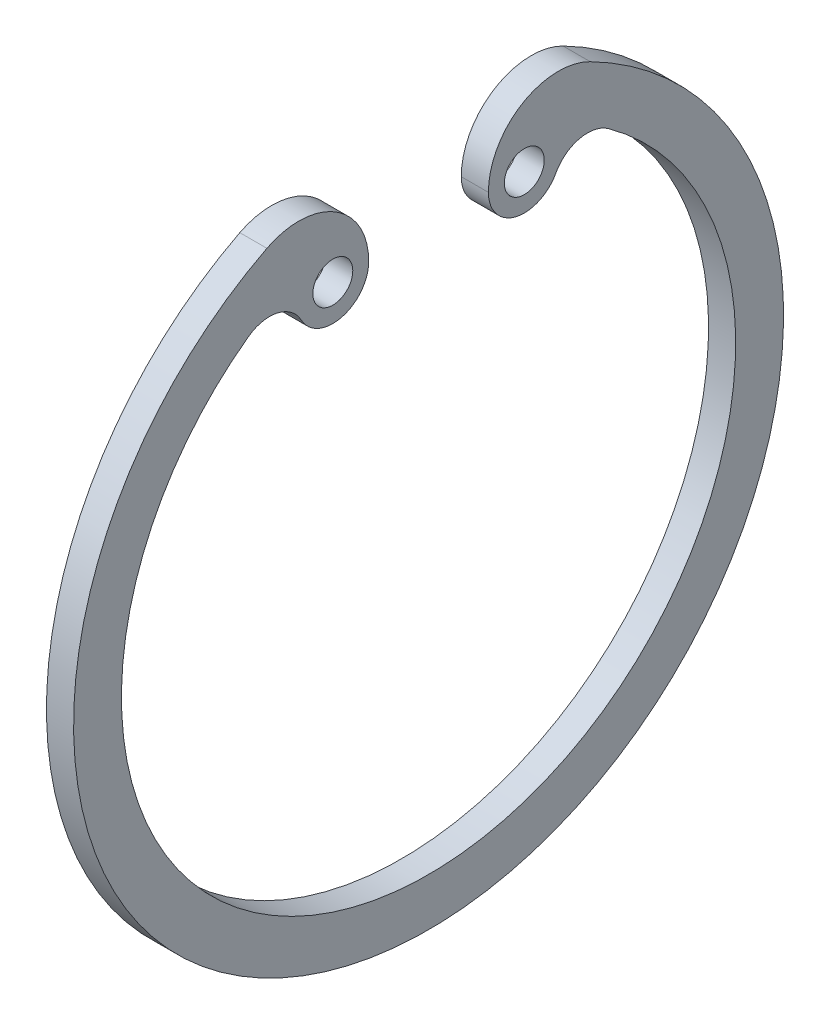
ISO-10303-21;
HEADER;
FILE_DESCRIPTION(('STEP AP214'),'2;1');
FILE_NAME('part.step','',(''),(''),'','','');
FILE_SCHEMA(('AUTOMOTIVE_DESIGN { 1 0 10303 214 1 1 1 1 }'));
ENDSEC;
DATA;
#1=APPLICATION_CONTEXT('core data for automotive mechanical design processes');
#2=APPLICATION_PROTOCOL_DEFINITION('international standard','automotive_design',2000,#1);
#3=PRODUCT_CONTEXT('',#1,'mechanical');
#4=PRODUCT('Part','Part','',(#3));
#5=PRODUCT_RELATED_PRODUCT_CATEGORY('part','',(#4));
#6=PRODUCT_DEFINITION_FORMATION('','',#4);
#7=PRODUCT_DEFINITION_CONTEXT('part definition',#1,'design');
#8=PRODUCT_DEFINITION('design','',#6,#7);
#9=PRODUCT_DEFINITION_SHAPE('','',#8);
#10=(LENGTH_UNIT() NAMED_UNIT(*) SI_UNIT(.MILLI.,.METRE.));
#11=(NAMED_UNIT(*) PLANE_ANGLE_UNIT() SI_UNIT($,.RADIAN.));
#12=(NAMED_UNIT(*) SI_UNIT($,.STERADIAN.) SOLID_ANGLE_UNIT());
#13=UNCERTAINTY_MEASURE_WITH_UNIT(LENGTH_MEASURE(1.E-05),#10,'distance_accuracy_value','');
#14=(GEOMETRIC_REPRESENTATION_CONTEXT(3) GLOBAL_UNCERTAINTY_ASSIGNED_CONTEXT((#13)) GLOBAL_UNIT_ASSIGNED_CONTEXT((#10,
#11,#12)) REPRESENTATION_CONTEXT('',''));
#15=CARTESIAN_POINT('',(0.,0.,0.));
#16=DIRECTION('',(0.,0.,1.));
#17=DIRECTION('',(1.,0.,0.));
#18=AXIS2_PLACEMENT_3D('',#15,#16,#17);
#19=CARTESIAN_POINT('',(1.7,15.9059737205869,7.0673076923077));
#20=DIRECTION('',(-1.,0.,0.));
#21=DIRECTION('',(0.,0.,1.));
#22=AXIS2_PLACEMENT_3D('',#19,#20,#21);
#23=PLANE('',#22);
#24=CARTESIAN_POINT('',(1.7,15.9059737205869,8.13461538461539));
#25=DIRECTION('',(1.,0.,0.));
#26=DIRECTION('',(0.,0.,1.));
#27=AXIS2_PLACEMENT_3D('',#24,#25,#26);
#28=CIRCLE('',#27,4.38461538461538);
#29=CARTESIAN_POINT('',(1.7,15.9059737205869,3.75));
#30=VERTEX_POINT('',#29);
#31=CARTESIAN_POINT('',(1.7,19.8097003172433,10.1310548977395));
#32=VERTEX_POINT('',#31);
#33=EDGE_CURVE('E158',#30,#32,#28,.T.);
#34=ORIENTED_EDGE('',*,*,#33,.T.);
#35=CARTESIAN_POINT('',(1.7,0.,0.));
#36=DIRECTION('',(1.,0.,0.));
#37=DIRECTION('',(0.,0.,-1.));
#38=AXIS2_PLACEMENT_3D('',#35,#36,#37);
#39=CIRCLE('',#38,22.25);
#40=CARTESIAN_POINT('',(1.7,19.8097003172433,-10.1310548977395));
#41=VERTEX_POINT('',#40);
#42=EDGE_CURVE('E106',#32,#41,#39,.T.);
#43=ORIENTED_EDGE('',*,*,#42,.T.);
#44=CARTESIAN_POINT('',(1.7,15.9059737205869,-8.13461538461539));
#45=DIRECTION('',(1.,0.,0.));
#46=DIRECTION('',(0.,0.,-1.));
#47=AXIS2_PLACEMENT_3D('',#44,#45,#46);
#48=CIRCLE('',#47,4.38461538461538);
#49=CARTESIAN_POINT('',(1.7,15.9059737205869,-3.75000000000001));
#50=VERTEX_POINT('',#49);
#51=EDGE_CURVE('E173',#41,#50,#48,.T.);
#52=ORIENTED_EDGE('',*,*,#51,.T.);
#53=CARTESIAN_POINT('',(1.7,15.9059737205869,-6.));
#54=DIRECTION('',(1.,0.,0.));
#55=DIRECTION('',(0.,0.,1.));
#56=AXIS2_PLACEMENT_3D('',#53,#54,#55);
#57=CIRCLE('',#56,2.25);
#58=CARTESIAN_POINT('',(1.7,14.8402124722021,-7.98157840153788));
#59=VERTEX_POINT('',#58);
#60=EDGE_CURVE('E186',#50,#59,#57,.T.);
#61=ORIENTED_EDGE('',*,*,#60,.T.);
#62=CARTESIAN_POINT('',(1.7,13.7744512238174,-9.96315680307576));
#63=DIRECTION('',(-1.,0.,0.));
#64=DIRECTION('',(0.,0.,-1.));
#65=AXIS2_PLACEMENT_3D('',#62,#63,#64);
#66=CIRCLE('',#65,2.25);
#67=CARTESIAN_POINT('',(1.7,15.5975403563815,-11.2818099093652));
#68=VERTEX_POINT('',#67);
#69=EDGE_CURVE('E125',#59,#68,#66,.T.);
#70=ORIENTED_EDGE('',*,*,#69,.T.);
#71=CARTESIAN_POINT('',(1.7,0.,0.));
#72=DIRECTION('',(-1.,0.,0.));
#73=DIRECTION('',(0.,0.,-1.));
#74=AXIS2_PLACEMENT_3D('',#71,#72,#73);
#75=CIRCLE('',#74,19.25);
#76=CARTESIAN_POINT('',(1.7,15.5975403563815,11.2818099093652));
#77=VERTEX_POINT('',#76);
#78=EDGE_CURVE('E119',#68,#77,#75,.T.);
#79=ORIENTED_EDGE('',*,*,#78,.T.);
#80=CARTESIAN_POINT('',(1.7,13.7744512238174,9.96315680307576));
#81=DIRECTION('',(-1.,0.,0.));
#82=DIRECTION('',(0.,0.,1.));
#83=AXIS2_PLACEMENT_3D('',#80,#81,#82);
#84=CIRCLE('',#83,2.25);
#85=CARTESIAN_POINT('',(1.7,14.8402124722021,7.98157840153788));
#86=VERTEX_POINT('',#85);
#87=EDGE_CURVE('E123',#77,#86,#84,.T.);
#88=ORIENTED_EDGE('',*,*,#87,.T.);
#89=CARTESIAN_POINT('',(1.7,15.9059737205869,6.));
#90=DIRECTION('',(1.,0.,0.));
#91=DIRECTION('',(0.,0.,-1.));
#92=AXIS2_PLACEMENT_3D('',#89,#90,#91);
#93=CIRCLE('',#92,2.25);
#94=EDGE_CURVE('E63',#86,#30,#93,.T.);
#95=ORIENTED_EDGE('',*,*,#94,.T.);
#96=EDGE_LOOP('',(#34,#43,#52,#61,#70,#79,#88,#95));
#97=FACE_BOUND('',#96,.T.);
#98=CARTESIAN_POINT('',(1.7,15.9059737205869,6.));
#99=DIRECTION('',(1.,0.,0.));
#100=DIRECTION('',(0.,0.,-1.));
#101=AXIS2_PLACEMENT_3D('',#98,#99,#100);
#102=CIRCLE('',#101,1.25);
#103=CARTESIAN_POINT('',(1.7,15.9059737205869,4.75));
#104=VERTEX_POINT('',#103);
#105=EDGE_CURVE('E147',#104,#104,#102,.T.);
#106=ORIENTED_EDGE('',*,*,#105,.F.);
#107=EDGE_LOOP('',(#106));
#108=FACE_BOUND('',#107,.T.);
#109=CARTESIAN_POINT('',(1.7,15.9059737205869,-6.));
#110=DIRECTION('',(1.,0.,0.));
#111=DIRECTION('',(0.,0.,1.));
#112=AXIS2_PLACEMENT_3D('',#109,#110,#111);
#113=CIRCLE('',#112,1.25);
#114=CARTESIAN_POINT('',(1.7,15.9059737205869,-4.75));
#115=VERTEX_POINT('',#114);
#116=EDGE_CURVE('E195',#115,#115,#113,.T.);
#117=ORIENTED_EDGE('',*,*,#116,.F.);
#118=EDGE_LOOP('',(#117));
#119=FACE_BOUND('',#118,.T.);
#120=ADVANCED_FACE('F46',(#97,#108,#119),#23,.F.);
#121=CARTESIAN_POINT('',(0.,15.9059737205869,7.0673076923077));
#122=DIRECTION('',(-1.,0.,0.));
#123=DIRECTION('',(0.,0.,1.));
#124=AXIS2_PLACEMENT_3D('',#121,#122,#123);
#125=PLANE('',#124);
#126=CARTESIAN_POINT('',(0.,15.9059737205869,6.));
#127=DIRECTION('',(1.,0.,0.));
#128=DIRECTION('',(0.,0.,-1.));
#129=AXIS2_PLACEMENT_3D('',#126,#127,#128);
#130=CIRCLE('',#129,1.25);
#131=CARTESIAN_POINT('',(0.,15.9059737205869,4.75));
#132=VERTEX_POINT('',#131);
#133=EDGE_CURVE('E192',#132,#132,#130,.T.);
#134=ORIENTED_EDGE('',*,*,#133,.T.);
#135=EDGE_LOOP('',(#134));
#136=FACE_BOUND('',#135,.T.);
#137=CARTESIAN_POINT('',(0.,15.9059737205869,8.13461538461539));
#138=DIRECTION('',(1.,0.,0.));
#139=DIRECTION('',(0.,0.,1.));
#140=AXIS2_PLACEMENT_3D('',#137,#138,#139);
#141=CIRCLE('',#140,4.38461538461538);
#142=CARTESIAN_POINT('',(0.,15.9059737205869,3.75));
#143=VERTEX_POINT('',#142);
#144=CARTESIAN_POINT('',(0.,19.8097003172433,10.1310548977395));
#145=VERTEX_POINT('',#144);
#146=EDGE_CURVE('E143',#143,#145,#141,.T.);
#147=ORIENTED_EDGE('',*,*,#146,.F.);
#148=CARTESIAN_POINT('',(0.,15.9059737205869,6.));
#149=DIRECTION('',(1.,0.,0.));
#150=DIRECTION('',(0.,0.,-1.));
#151=AXIS2_PLACEMENT_3D('',#148,#149,#150);
#152=CIRCLE('',#151,2.25);
#153=CARTESIAN_POINT('',(0.,14.8402124722021,7.98157840153788));
#154=VERTEX_POINT('',#153);
#155=EDGE_CURVE('E98',#154,#143,#152,.T.);
#156=ORIENTED_EDGE('',*,*,#155,.F.);
#157=CARTESIAN_POINT('',(0.,13.7744512238174,9.96315680307576));
#158=DIRECTION('',(-1.,0.,0.));
#159=DIRECTION('',(0.,0.,1.));
#160=AXIS2_PLACEMENT_3D('',#157,#158,#159);
#161=CIRCLE('',#160,2.25);
#162=CARTESIAN_POINT('',(0.,15.5975403563815,11.2818099093652));
#163=VERTEX_POINT('',#162);
#164=EDGE_CURVE('E92',#163,#154,#161,.T.);
#165=ORIENTED_EDGE('',*,*,#164,.F.);
#166=CARTESIAN_POINT('',(0.,0.,0.));
#167=DIRECTION('',(-1.,0.,0.));
#168=DIRECTION('',(0.,0.,-1.));
#169=AXIS2_PLACEMENT_3D('',#166,#167,#168);
#170=CIRCLE('',#169,19.25);
#171=CARTESIAN_POINT('',(0.,15.5975403563815,-11.2818099093652));
#172=VERTEX_POINT('',#171);
#173=EDGE_CURVE('E133',#172,#163,#170,.T.);
#174=ORIENTED_EDGE('',*,*,#173,.F.);
#175=CARTESIAN_POINT('',(0.,13.7744512238174,-9.96315680307576));
#176=DIRECTION('',(-1.,0.,0.));
#177=DIRECTION('',(0.,0.,-1.));
#178=AXIS2_PLACEMENT_3D('',#175,#176,#177);
#179=CIRCLE('',#178,2.25);
#180=CARTESIAN_POINT('',(0.,14.8402124722021,-7.98157840153788));
#181=VERTEX_POINT('',#180);
#182=EDGE_CURVE('E153',#181,#172,#179,.T.);
#183=ORIENTED_EDGE('',*,*,#182,.F.);
#184=CARTESIAN_POINT('',(0.,15.9059737205869,-6.));
#185=DIRECTION('',(1.,0.,0.));
#186=DIRECTION('',(0.,0.,1.));
#187=AXIS2_PLACEMENT_3D('',#184,#185,#186);
#188=CIRCLE('',#187,2.25);
#189=CARTESIAN_POINT('',(0.,15.9059737205869,-3.75000000000001));
#190=VERTEX_POINT('',#189);
#191=EDGE_CURVE('E151',#190,#181,#188,.T.);
#192=ORIENTED_EDGE('',*,*,#191,.F.);
#193=CARTESIAN_POINT('',(0.,15.9059737205869,-8.13461538461539));
#194=DIRECTION('',(1.,0.,0.));
#195=DIRECTION('',(0.,0.,-1.));
#196=AXIS2_PLACEMENT_3D('',#193,#194,#195);
#197=CIRCLE('',#196,4.38461538461538);
#198=CARTESIAN_POINT('',(0.,19.8097003172433,-10.1310548977395));
#199=VERTEX_POINT('',#198);
#200=EDGE_CURVE('E149',#199,#190,#197,.T.);
#201=ORIENTED_EDGE('',*,*,#200,.F.);
#202=CARTESIAN_POINT('',(0.,0.,0.));
#203=DIRECTION('',(1.,0.,0.));
#204=DIRECTION('',(0.,0.,-1.));
#205=AXIS2_PLACEMENT_3D('',#202,#203,#204);
#206=CIRCLE('',#205,22.25);
#207=EDGE_CURVE('E146',#145,#199,#206,.T.);
#208=ORIENTED_EDGE('',*,*,#207,.F.);
#209=EDGE_LOOP('',(#147,#156,#165,#174,#183,#192,#201,#208));
#210=FACE_BOUND('',#209,.T.);
#211=CARTESIAN_POINT('',(0.,15.9059737205869,-6.));
#212=DIRECTION('',(1.,0.,0.));
#213=DIRECTION('',(0.,0.,1.));
#214=AXIS2_PLACEMENT_3D('',#211,#212,#213);
#215=CIRCLE('',#214,1.25);
#216=CARTESIAN_POINT('',(0.,15.9059737205869,-4.75));
#217=VERTEX_POINT('',#216);
#218=EDGE_CURVE('E198',#217,#217,#215,.T.);
#219=ORIENTED_EDGE('',*,*,#218,.T.);
#220=EDGE_LOOP('',(#219));
#221=FACE_BOUND('',#220,.T.);
#222=ADVANCED_FACE('F177',(#136,#210,#221),#125,.T.);
#223=CARTESIAN_POINT('',(1.7,15.9059737205869,8.13461538461539));
#224=DIRECTION('',(-1.,0.,0.));
#225=DIRECTION('',(0.,0.,1.));
#226=AXIS2_PLACEMENT_3D('',#223,#224,#225);
#227=CYLINDRICAL_SURFACE('',#226,4.38461538461538);
#228=ORIENTED_EDGE('',*,*,#146,.T.);
#229=DIRECTION('',(-1.,0.,0.));
#230=VECTOR('',#229,1.);
#231=CARTESIAN_POINT('',(1.7,19.8097003172433,10.1310548977395));
#232=LINE('',#231,#230);
#233=EDGE_CURVE('E13',#32,#145,#232,.T.);
#234=ORIENTED_EDGE('',*,*,#233,.F.);
#235=ORIENTED_EDGE('',*,*,#33,.F.);
#236=DIRECTION('',(-1.,0.,0.));
#237=VECTOR('',#236,1.);
#238=CARTESIAN_POINT('',(1.7,15.9059737205869,3.75));
#239=LINE('',#238,#237);
#240=EDGE_CURVE('E139',#30,#143,#239,.T.);
#241=ORIENTED_EDGE('',*,*,#240,.T.);
#242=EDGE_LOOP('',(#228,#234,#235,#241));
#243=FACE_BOUND('',#242,.T.);
#244=ADVANCED_FACE('F48',(#243),#227,.T.);
#245=CARTESIAN_POINT('',(1.7,0.,0.));
#246=DIRECTION('',(-1.,0.,0.));
#247=DIRECTION('',(0.,0.,1.));
#248=AXIS2_PLACEMENT_3D('',#245,#246,#247);
#249=CYLINDRICAL_SURFACE('',#248,22.25);
#250=ORIENTED_EDGE('',*,*,#207,.T.);
#251=DIRECTION('',(-1.,0.,0.));
#252=VECTOR('',#251,1.);
#253=CARTESIAN_POINT('',(1.7,19.8097003172433,-10.1310548977395));
#254=LINE('',#253,#252);
#255=EDGE_CURVE('E55',#41,#199,#254,.T.);
#256=ORIENTED_EDGE('',*,*,#255,.F.);
#257=ORIENTED_EDGE('',*,*,#42,.F.);
#258=ORIENTED_EDGE('',*,*,#233,.T.);
#259=EDGE_LOOP('',(#250,#256,#257,#258));
#260=FACE_BOUND('',#259,.T.);
#261=ADVANCED_FACE('F230',(#260),#249,.T.);
#262=CARTESIAN_POINT('',(1.7,15.9059737205869,-8.13461538461539));
#263=DIRECTION('',(-1.,0.,0.));
#264=DIRECTION('',(0.,0.,1.));
#265=AXIS2_PLACEMENT_3D('',#262,#263,#264);
#266=CYLINDRICAL_SURFACE('',#265,4.38461538461538);
#267=ORIENTED_EDGE('',*,*,#200,.T.);
#268=DIRECTION('',(-1.,0.,0.));
#269=VECTOR('',#268,1.);
#270=CARTESIAN_POINT('',(1.7,15.9059737205869,-3.75000000000001));
#271=LINE('',#270,#269);
#272=EDGE_CURVE('E165',#50,#190,#271,.T.);
#273=ORIENTED_EDGE('',*,*,#272,.F.);
#274=ORIENTED_EDGE('',*,*,#51,.F.);
#275=ORIENTED_EDGE('',*,*,#255,.T.);
#276=EDGE_LOOP('',(#267,#273,#274,#275));
#277=FACE_BOUND('',#276,.T.);
#278=ADVANCED_FACE('F171',(#277),#266,.T.);
#279=CARTESIAN_POINT('',(1.7,15.9059737205869,-6.));
#280=DIRECTION('',(-1.,0.,0.));
#281=DIRECTION('',(0.,0.,1.));
#282=AXIS2_PLACEMENT_3D('',#279,#280,#281);
#283=CYLINDRICAL_SURFACE('',#282,2.25);
#284=ORIENTED_EDGE('',*,*,#191,.T.);
#285=DIRECTION('',(-1.,0.,0.));
#286=VECTOR('',#285,1.);
#287=CARTESIAN_POINT('',(1.7,14.8402124722021,-7.98157840153788));
#288=LINE('',#287,#286);
#289=EDGE_CURVE('E162',#59,#181,#288,.T.);
#290=ORIENTED_EDGE('',*,*,#289,.F.);
#291=ORIENTED_EDGE('',*,*,#60,.F.);
#292=ORIENTED_EDGE('',*,*,#272,.T.);
#293=EDGE_LOOP('',(#284,#290,#291,#292));
#294=FACE_BOUND('',#293,.T.);
#295=ADVANCED_FACE('F182',(#294),#283,.T.);
#296=CARTESIAN_POINT('',(1.7,13.7744512238174,-9.96315680307576));
#297=DIRECTION('',(-1.,0.,0.));
#298=DIRECTION('',(0.,0.,1.));
#299=AXIS2_PLACEMENT_3D('',#296,#297,#298);
#300=CYLINDRICAL_SURFACE('',#299,2.25);
#301=ORIENTED_EDGE('',*,*,#182,.T.);
#302=DIRECTION('',(-1.,0.,0.));
#303=VECTOR('',#302,1.);
#304=CARTESIAN_POINT('',(1.7,15.5975403563815,-11.2818099093652));
#305=LINE('',#304,#303);
#306=EDGE_CURVE('E134',#68,#172,#305,.T.);
#307=ORIENTED_EDGE('',*,*,#306,.F.);
#308=ORIENTED_EDGE('',*,*,#69,.F.);
#309=ORIENTED_EDGE('',*,*,#289,.T.);
#310=EDGE_LOOP('',(#301,#307,#308,#309));
#311=FACE_BOUND('',#310,.T.);
#312=ADVANCED_FACE('F185',(#311),#300,.F.);
#313=CARTESIAN_POINT('',(1.7,0.,0.));
#314=DIRECTION('',(-1.,0.,0.));
#315=DIRECTION('',(0.,0.,1.));
#316=AXIS2_PLACEMENT_3D('',#313,#314,#315);
#317=CYLINDRICAL_SURFACE('',#316,19.25);
#318=ORIENTED_EDGE('',*,*,#173,.T.);
#319=DIRECTION('',(-1.,0.,0.));
#320=VECTOR('',#319,1.);
#321=CARTESIAN_POINT('',(1.7,15.5975403563815,11.2818099093652));
#322=LINE('',#321,#320);
#323=EDGE_CURVE('E130',#77,#163,#322,.T.);
#324=ORIENTED_EDGE('',*,*,#323,.F.);
#325=ORIENTED_EDGE('',*,*,#78,.F.);
#326=ORIENTED_EDGE('',*,*,#306,.T.);
#327=EDGE_LOOP('',(#318,#324,#325,#326));
#328=FACE_BOUND('',#327,.T.);
#329=ADVANCED_FACE('F131',(#328),#317,.F.);
#330=CARTESIAN_POINT('',(1.7,13.7744512238174,9.96315680307576));
#331=DIRECTION('',(-1.,0.,0.));
#332=DIRECTION('',(0.,0.,1.));
#333=AXIS2_PLACEMENT_3D('',#330,#331,#332);
#334=CYLINDRICAL_SURFACE('',#333,2.25);
#335=ORIENTED_EDGE('',*,*,#164,.T.);
#336=DIRECTION('',(-1.,0.,0.));
#337=VECTOR('',#336,1.);
#338=CARTESIAN_POINT('',(1.7,14.8402124722021,7.98157840153788));
#339=LINE('',#338,#337);
#340=EDGE_CURVE('E135',#86,#154,#339,.T.);
#341=ORIENTED_EDGE('',*,*,#340,.F.);
#342=ORIENTED_EDGE('',*,*,#87,.F.);
#343=ORIENTED_EDGE('',*,*,#323,.T.);
#344=EDGE_LOOP('',(#335,#341,#342,#343));
#345=FACE_BOUND('',#344,.T.);
#346=ADVANCED_FACE('F137',(#345),#334,.F.);
#347=CARTESIAN_POINT('',(1.7,15.9059737205869,6.));
#348=DIRECTION('',(-1.,0.,0.));
#349=DIRECTION('',(0.,0.,1.));
#350=AXIS2_PLACEMENT_3D('',#347,#348,#349);
#351=CYLINDRICAL_SURFACE('',#350,2.25);
#352=ORIENTED_EDGE('',*,*,#155,.T.);
#353=ORIENTED_EDGE('',*,*,#240,.F.);
#354=ORIENTED_EDGE('',*,*,#94,.F.);
#355=ORIENTED_EDGE('',*,*,#340,.T.);
#356=EDGE_LOOP('',(#352,#353,#354,#355));
#357=FACE_BOUND('',#356,.T.);
#358=ADVANCED_FACE('F218',(#357),#351,.T.);
#359=CARTESIAN_POINT('',(1.7,15.9059737205869,6.));
#360=DIRECTION('',(-1.,0.,0.));
#361=DIRECTION('',(0.,0.,1.));
#362=AXIS2_PLACEMENT_3D('',#359,#360,#361);
#363=CYLINDRICAL_SURFACE('',#362,1.25);
#364=ORIENTED_EDGE('',*,*,#105,.T.);
#365=EDGE_LOOP('',(#364));
#366=FACE_BOUND('',#365,.T.);
#367=ORIENTED_EDGE('',*,*,#133,.F.);
#368=EDGE_LOOP('',(#367));
#369=FACE_BOUND('',#368,.T.);
#370=ADVANCED_FACE('F215',(#366,#369),#363,.F.);
#371=CARTESIAN_POINT('',(1.7,15.9059737205869,-6.));
#372=DIRECTION('',(-1.,0.,0.));
#373=DIRECTION('',(0.,0.,1.));
#374=AXIS2_PLACEMENT_3D('',#371,#372,#373);
#375=CYLINDRICAL_SURFACE('',#374,1.25);
#376=ORIENTED_EDGE('',*,*,#116,.T.);
#377=EDGE_LOOP('',(#376));
#378=FACE_BOUND('',#377,.T.);
#379=ORIENTED_EDGE('',*,*,#218,.F.);
#380=EDGE_LOOP('',(#379));
#381=FACE_BOUND('',#380,.T.);
#382=ADVANCED_FACE('F204',(#378,#381),#375,.F.);
#383=CLOSED_SHELL('',(#120,#222,#244,#261,#278,#295,#312,#329,#346,#358,#370,#382));
#384=MANIFOLD_SOLID_BREP('B2',#383);
#385=ADVANCED_BREP_SHAPE_REPRESENTATION('',(#18,#384),#14);
#386=SHAPE_DEFINITION_REPRESENTATION(#9,#385);
ENDSEC;
END-ISO-10303-21;
